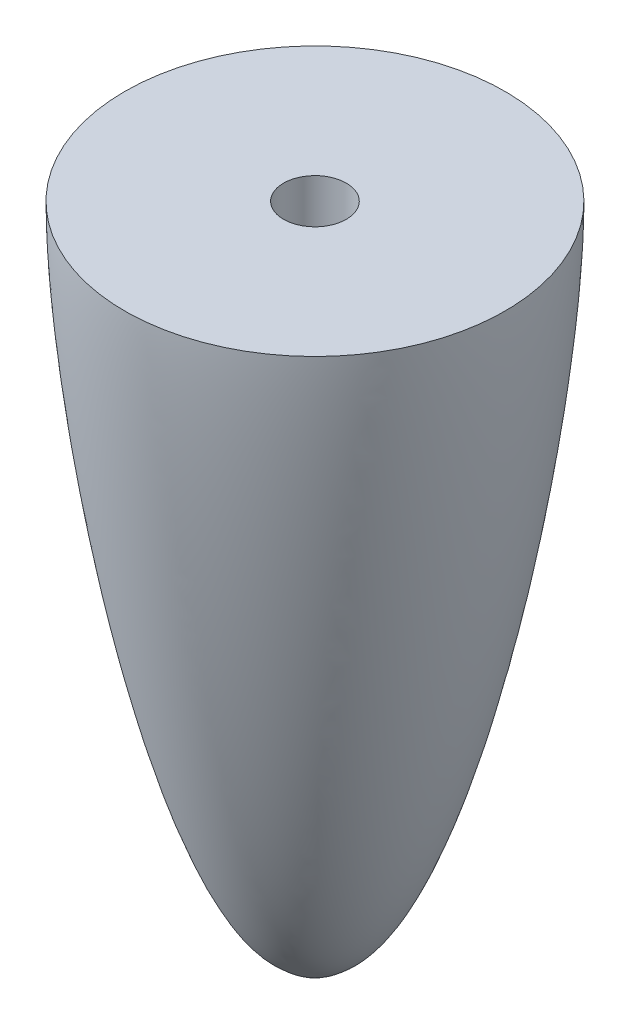
ISO-10303-21;
HEADER;
FILE_DESCRIPTION(('STEP AP214'),'2;1');
FILE_NAME('part.step','',(''),(''),'','','');
FILE_SCHEMA(('AUTOMOTIVE_DESIGN { 1 0 10303 214 1 1 1 1 }'));
ENDSEC;
DATA;
#1=APPLICATION_CONTEXT('core data for automotive mechanical design processes');
#2=APPLICATION_PROTOCOL_DEFINITION('international standard','automotive_design',2000,#1);
#3=PRODUCT_CONTEXT('',#1,'mechanical');
#4=PRODUCT('Part','Part','',(#3));
#5=PRODUCT_RELATED_PRODUCT_CATEGORY('part','',(#4));
#6=PRODUCT_DEFINITION_FORMATION('','',#4);
#7=PRODUCT_DEFINITION_CONTEXT('part definition',#1,'design');
#8=PRODUCT_DEFINITION('design','',#6,#7);
#9=PRODUCT_DEFINITION_SHAPE('','',#8);
#10=(LENGTH_UNIT() NAMED_UNIT(*) SI_UNIT(.MILLI.,.METRE.));
#11=(NAMED_UNIT(*) PLANE_ANGLE_UNIT() SI_UNIT($,.RADIAN.));
#12=(NAMED_UNIT(*) SI_UNIT($,.STERADIAN.) SOLID_ANGLE_UNIT());
#13=UNCERTAINTY_MEASURE_WITH_UNIT(LENGTH_MEASURE(1.E-05),#10,'distance_accuracy_value','');
#14=(GEOMETRIC_REPRESENTATION_CONTEXT(3) GLOBAL_UNCERTAINTY_ASSIGNED_CONTEXT((#13)) GLOBAL_UNIT_ASSIGNED_CONTEXT((#10,
#11,#12)) REPRESENTATION_CONTEXT('',''));
#15=CARTESIAN_POINT('',(0.,0.,0.));
#16=DIRECTION('',(0.,0.,1.));
#17=DIRECTION('',(1.,0.,0.));
#18=AXIS2_PLACEMENT_3D('',#15,#16,#17);
#19=CARTESIAN_POINT('',(0.,14.,0.));
#20=DIRECTION('',(0.,1.,0.));
#21=DIRECTION('',(-1.,0.,0.));
#22=AXIS2_PLACEMENT_3D('',#19,#20,#21);
#23=PLANE('',#22);
#24=CARTESIAN_POINT('',(0.,14.,0.));
#25=DIRECTION('',(0.,1.,0.));
#26=DIRECTION('',(0.,0.,1.));
#27=AXIS2_PLACEMENT_3D('',#24,#25,#26);
#28=CIRCLE('',#27,1.64999999999999);
#29=CARTESIAN_POINT('',(0.,14.,1.64999999999999));
#30=VERTEX_POINT('',#29);
#31=EDGE_CURVE('E60',#30,#30,#28,.T.);
#32=ORIENTED_EDGE('',*,*,#31,.F.);
#33=EDGE_LOOP('',(#32));
#34=FACE_BOUND('',#33,.T.);
#35=CARTESIAN_POINT('',(0.,14.,0.));
#36=DIRECTION('',(0.,1.,0.));
#37=DIRECTION('',(-1.,0.,0.));
#38=AXIS2_PLACEMENT_3D('',#35,#36,#37);
#39=CIRCLE('',#38,10.);
#40=CARTESIAN_POINT('',(-10.,14.,0.));
#41=VERTEX_POINT('',#40);
#42=EDGE_CURVE('E44',#41,#41,#39,.T.);
#43=ORIENTED_EDGE('',*,*,#42,.T.);
#44=EDGE_LOOP('',(#43));
#45=FACE_BOUND('',#44,.T.);
#46=ADVANCED_FACE('F37',(#34,#45),#23,.T.);
#47=CARTESIAN_POINT('',(-1.5,-20.3,0.));
#48=CARTESIAN_POINT('',(-1.46020394216111,-20.3318761332677,0.));
#49=CARTESIAN_POINT('',(-0.662919650912761,-20.964459535565,0.));
#50=CARTESIAN_POINT('',(-0.207667433921271,-21.,0.));
#51=CARTESIAN_POINT('',(0.,-21.,0.));
#52=B_SPLINE_CURVE_WITH_KNOTS('',3,(#47,#48,#49,#50,#51),.UNSPECIFIED.,.F.,.F.,(4,1,4),(0.,0.05,
1.),.UNSPECIFIED.);
#53=CARTESIAN_POINT('',(0.,14.,0.));
#54=DIRECTION('',(0.,1.,0.));
#55=AXIS1_PLACEMENT('',#53,#54);
#56=SURFACE_OF_REVOLUTION('',#52,#55);
#57=CARTESIAN_POINT('',(0.,-21.,0.));
#58=VERTEX_POINT('',#57);
#59=VERTEX_LOOP('',#58);
#60=FACE_BOUND('',#59,.T.);
#61=CARTESIAN_POINT('',(0.,-20.3,0.));
#62=DIRECTION('',(0.,1.,0.));
#63=DIRECTION('',(-1.,0.,0.));
#64=AXIS2_PLACEMENT_3D('',#61,#62,#63);
#65=CIRCLE('',#64,1.5);
#66=CARTESIAN_POINT('',(-1.5,-20.3,0.));
#67=VERTEX_POINT('',#66);
#68=EDGE_CURVE('E11',#67,#67,#65,.T.);
#69=ORIENTED_EDGE('',*,*,#68,.F.);
#70=EDGE_LOOP('',(#69));
#71=FACE_BOUND('',#70,.T.);
#72=ADVANCED_FACE('F78',(#60,#71),#56,.F.);
#73=CARTESIAN_POINT('',(-10.,14.,0.));
#74=CARTESIAN_POINT('',(-10.,5.64870191082056,0.));
#75=CARTESIAN_POINT('',(-6.48848556949806,-16.0631105902795,0.));
#76=CARTESIAN_POINT('',(-1.7516566996758,-20.0984262026896,0.));
#77=CARTESIAN_POINT('',(-1.49999999999999,-20.3,0.));
#78=B_SPLINE_CURVE_WITH_KNOTS('',3,(#73,#74,#75,#76,#77),.UNSPECIFIED.,.F.,.F.,(4,1,4),(0.,0.95,
1.),.UNSPECIFIED.);
#79=CARTESIAN_POINT('',(0.,14.,0.));
#80=DIRECTION('',(0.,1.,0.));
#81=AXIS1_PLACEMENT('',#79,#80);
#82=SURFACE_OF_REVOLUTION('',#78,#81);
#83=ORIENTED_EDGE('',*,*,#68,.T.);
#84=EDGE_LOOP('',(#83));
#85=FACE_BOUND('',#84,.T.);
#86=ORIENTED_EDGE('',*,*,#42,.F.);
#87=EDGE_LOOP('',(#86));
#88=FACE_BOUND('',#87,.T.);
#89=ADVANCED_FACE('F54',(#85,#88),#82,.F.);
#90=CARTESIAN_POINT('',(0.,-8.,0.));
#91=DIRECTION('',(0.,1.,0.));
#92=DIRECTION('',(0.,0.,1.));
#93=AXIS2_PLACEMENT_3D('',#90,#91,#92);
#94=CONICAL_SURFACE('',#93,1.65,1.02974425867665);
#95=CARTESIAN_POINT('',(0.,-8.99142002139548,0.));
#96=VERTEX_POINT('',#95);
#97=VERTEX_LOOP('',#96);
#98=FACE_BOUND('',#97,.T.);
#99=CARTESIAN_POINT('',(0.,-8.,0.));
#100=DIRECTION('',(0.,1.,0.));
#101=DIRECTION('',(0.,0.,1.));
#102=AXIS2_PLACEMENT_3D('',#99,#100,#101);
#103=CIRCLE('',#102,1.65);
#104=CARTESIAN_POINT('',(0.,-8.,1.65));
#105=VERTEX_POINT('',#104);
#106=EDGE_CURVE('E58',#105,#105,#103,.T.);
#107=ORIENTED_EDGE('',*,*,#106,.T.);
#108=EDGE_LOOP('',(#107));
#109=FACE_BOUND('',#108,.T.);
#110=ADVANCED_FACE('F50',(#98,#109),#94,.F.);
#111=CARTESIAN_POINT('',(0.,14.,0.));
#112=DIRECTION('',(0.,1.,0.));
#113=DIRECTION('',(0.,0.,1.));
#114=AXIS2_PLACEMENT_3D('',#111,#112,#113);
#115=CYLINDRICAL_SURFACE('',#114,1.64999999999999);
#116=ORIENTED_EDGE('',*,*,#106,.F.);
#117=EDGE_LOOP('',(#116));
#118=FACE_BOUND('',#117,.T.);
#119=ORIENTED_EDGE('',*,*,#31,.T.);
#120=EDGE_LOOP('',(#119));
#121=FACE_BOUND('',#120,.T.);
#122=ADVANCED_FACE('F53',(#118,#121),#115,.F.);
#123=CLOSED_SHELL('',(#46,#72,#89,#110,#122));
#124=MANIFOLD_SOLID_BREP('B2',#123);
#125=ADVANCED_BREP_SHAPE_REPRESENTATION('',(#18,#124),#14);
#126=SHAPE_DEFINITION_REPRESENTATION(#9,#125);
ENDSEC;
END-ISO-10303-21;
